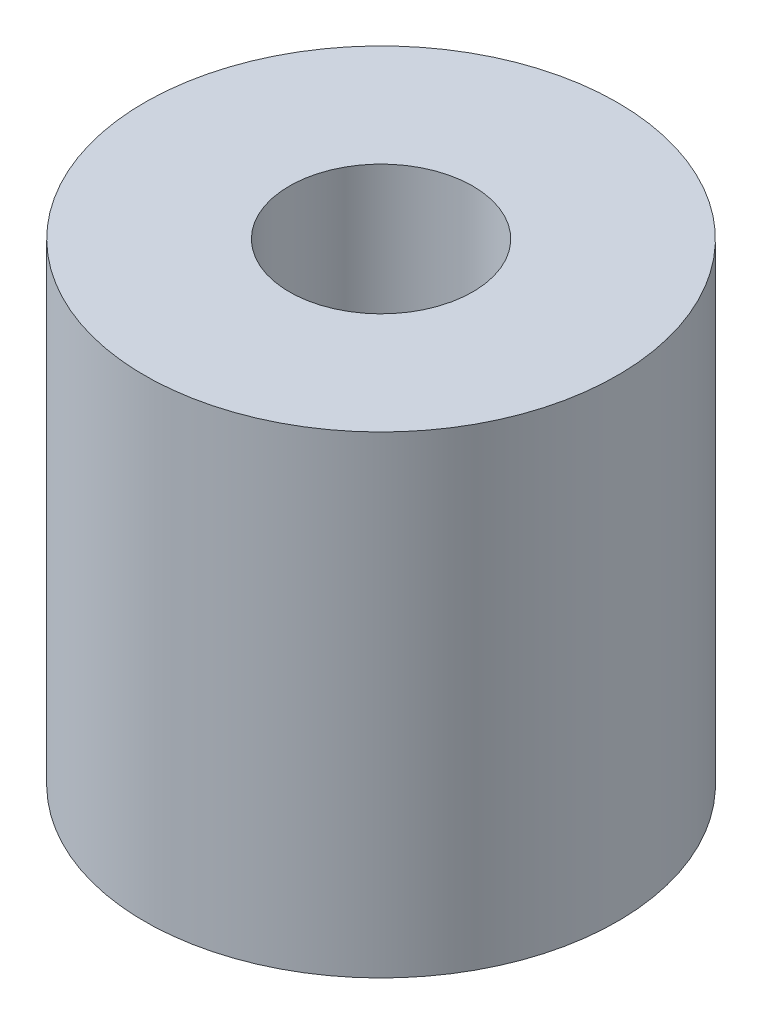
ISO-10303-21;
HEADER;
FILE_DESCRIPTION(('STEP AP214'),'2;1');
FILE_NAME('part.step','',(''),(''),'','','');
FILE_SCHEMA(('AUTOMOTIVE_DESIGN { 1 0 10303 214 1 1 1 1 }'));
ENDSEC;
DATA;
#1=APPLICATION_CONTEXT('core data for automotive mechanical design processes');
#2=APPLICATION_PROTOCOL_DEFINITION('international standard','automotive_design',2000,#1);
#3=PRODUCT_CONTEXT('',#1,'mechanical');
#4=PRODUCT('Part','Part','',(#3));
#5=PRODUCT_RELATED_PRODUCT_CATEGORY('part','',(#4));
#6=PRODUCT_DEFINITION_FORMATION('','',#4);
#7=PRODUCT_DEFINITION_CONTEXT('part definition',#1,'design');
#8=PRODUCT_DEFINITION('design','',#6,#7);
#9=PRODUCT_DEFINITION_SHAPE('','',#8);
#10=(LENGTH_UNIT() NAMED_UNIT(*) SI_UNIT(.MILLI.,.METRE.));
#11=(NAMED_UNIT(*) PLANE_ANGLE_UNIT() SI_UNIT($,.RADIAN.));
#12=(NAMED_UNIT(*) SI_UNIT($,.STERADIAN.) SOLID_ANGLE_UNIT());
#13=UNCERTAINTY_MEASURE_WITH_UNIT(LENGTH_MEASURE(1.E-05),#10,'distance_accuracy_value','');
#14=(GEOMETRIC_REPRESENTATION_CONTEXT(3) GLOBAL_UNCERTAINTY_ASSIGNED_CONTEXT((#13)) GLOBAL_UNIT_ASSIGNED_CONTEXT((#10,
#11,#12)) REPRESENTATION_CONTEXT('',''));
#15=CARTESIAN_POINT('',(0.,0.,0.));
#16=DIRECTION('',(0.,0.,1.));
#17=DIRECTION('',(1.,0.,0.));
#18=AXIS2_PLACEMENT_3D('',#15,#16,#17);
#19=CARTESIAN_POINT('',(0.,6.35,0.));
#20=DIRECTION('',(0.,-1.,0.));
#21=DIRECTION('',(0.,0.,-1.));
#22=AXIS2_PLACEMENT_3D('',#19,#20,#21);
#23=CYLINDRICAL_SURFACE('',#22,2.4638);
#24=CARTESIAN_POINT('',(0.,-6.35,0.));
#25=DIRECTION('',(0.,-1.,0.));
#26=DIRECTION('',(0.,0.,-1.));
#27=AXIS2_PLACEMENT_3D('',#24,#25,#26);
#28=CIRCLE('',#27,2.4638);
#29=CARTESIAN_POINT('',(0.,-6.35,-2.4638));
#30=VERTEX_POINT('',#29);
#31=EDGE_CURVE('E28',#30,#30,#28,.T.);
#32=ORIENTED_EDGE('',*,*,#31,.T.);
#33=EDGE_LOOP('',(#32));
#34=FACE_BOUND('',#33,.T.);
#35=CARTESIAN_POINT('',(0.,6.35,0.));
#36=DIRECTION('',(0.,-1.,0.));
#37=DIRECTION('',(0.,0.,-1.));
#38=AXIS2_PLACEMENT_3D('',#35,#36,#37);
#39=CIRCLE('',#38,2.4638);
#40=CARTESIAN_POINT('',(0.,6.35,-2.4638));
#41=VERTEX_POINT('',#40);
#42=EDGE_CURVE('E19',#41,#41,#39,.T.);
#43=ORIENTED_EDGE('',*,*,#42,.F.);
#44=EDGE_LOOP('',(#43));
#45=FACE_BOUND('',#44,.T.);
#46=ADVANCED_FACE('F16',(#34,#45),#23,.F.);
#47=CARTESIAN_POINT('',(0.,6.35,0.));
#48=DIRECTION('',(0.,1.,0.));
#49=DIRECTION('',(0.,0.,1.));
#50=AXIS2_PLACEMENT_3D('',#47,#48,#49);
#51=PLANE('',#50);
#52=ORIENTED_EDGE('',*,*,#42,.T.);
#53=EDGE_LOOP('',(#52));
#54=FACE_BOUND('',#53,.T.);
#55=CARTESIAN_POINT('',(0.,6.35,0.));
#56=DIRECTION('',(0.,-1.,0.));
#57=DIRECTION('',(0.,0.,-1.));
#58=AXIS2_PLACEMENT_3D('',#55,#56,#57);
#59=CIRCLE('',#58,6.35);
#60=CARTESIAN_POINT('',(0.,6.35,-6.35));
#61=VERTEX_POINT('',#60);
#62=EDGE_CURVE('E23',#61,#61,#59,.T.);
#63=ORIENTED_EDGE('',*,*,#62,.F.);
#64=EDGE_LOOP('',(#63));
#65=FACE_BOUND('',#64,.T.);
#66=ADVANCED_FACE('F36',(#54,#65),#51,.T.);
#67=CARTESIAN_POINT('',(0.,-6.35,0.));
#68=DIRECTION('',(0.,1.,0.));
#69=DIRECTION('',(0.,0.,1.));
#70=AXIS2_PLACEMENT_3D('',#67,#68,#69);
#71=PLANE('',#70);
#72=ORIENTED_EDGE('',*,*,#31,.F.);
#73=EDGE_LOOP('',(#72));
#74=FACE_BOUND('',#73,.T.);
#75=CARTESIAN_POINT('',(0.,-6.35,0.));
#76=DIRECTION('',(0.,-1.,0.));
#77=DIRECTION('',(0.,0.,-1.));
#78=AXIS2_PLACEMENT_3D('',#75,#76,#77);
#79=CIRCLE('',#78,6.35);
#80=CARTESIAN_POINT('',(0.,-6.35,-6.35));
#81=VERTEX_POINT('',#80);
#82=EDGE_CURVE('E10',#81,#81,#79,.F.);
#83=ORIENTED_EDGE('',*,*,#82,.F.);
#84=EDGE_LOOP('',(#83));
#85=FACE_BOUND('',#84,.T.);
#86=ADVANCED_FACE('F43',(#74,#85),#71,.F.);
#87=CARTESIAN_POINT('',(0.,6.35,0.));
#88=DIRECTION('',(0.,-1.,0.));
#89=DIRECTION('',(0.,0.,-1.));
#90=AXIS2_PLACEMENT_3D('',#87,#88,#89);
#91=CYLINDRICAL_SURFACE('',#90,6.35);
#92=ORIENTED_EDGE('',*,*,#62,.T.);
#93=EDGE_LOOP('',(#92));
#94=FACE_BOUND('',#93,.T.);
#95=ORIENTED_EDGE('',*,*,#82,.T.);
#96=EDGE_LOOP('',(#95));
#97=FACE_BOUND('',#96,.T.);
#98=ADVANCED_FACE('F44',(#94,#97),#91,.T.);
#99=CLOSED_SHELL('',(#46,#66,#86,#98));
#100=MANIFOLD_SOLID_BREP('B1',#99);
#101=ADVANCED_BREP_SHAPE_REPRESENTATION('',(#18,#100),#14);
#102=SHAPE_DEFINITION_REPRESENTATION(#9,#101);
ENDSEC;
END-ISO-10303-21;
